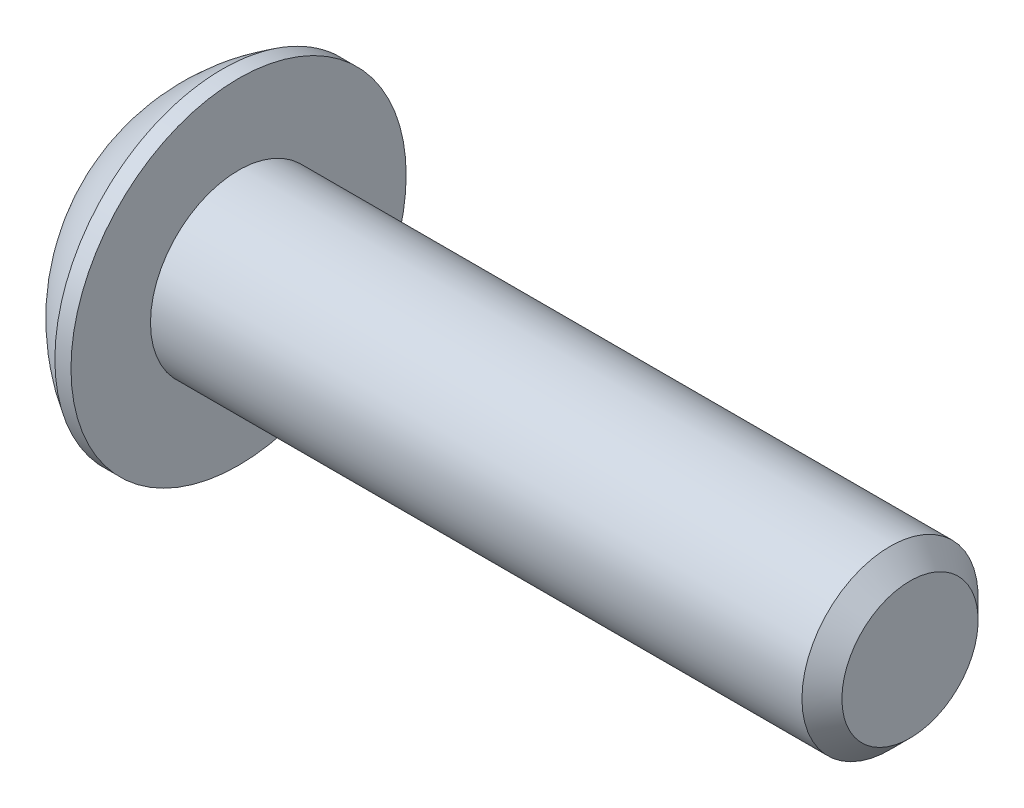
ISO-10303-21;
HEADER;
FILE_DESCRIPTION(('STEP AP214'),'2;1');
FILE_NAME('part.step','',(''),(''),'','','');
FILE_SCHEMA(('AUTOMOTIVE_DESIGN { 1 0 10303 214 1 1 1 1 }'));
ENDSEC;
DATA;
#1=APPLICATION_CONTEXT('core data for automotive mechanical design processes');
#2=APPLICATION_PROTOCOL_DEFINITION('international standard','automotive_design',2000,#1);
#3=PRODUCT_CONTEXT('',#1,'mechanical');
#4=PRODUCT('Part','Part','',(#3));
#5=PRODUCT_RELATED_PRODUCT_CATEGORY('part','',(#4));
#6=PRODUCT_DEFINITION_FORMATION('','',#4);
#7=PRODUCT_DEFINITION_CONTEXT('part definition',#1,'design');
#8=PRODUCT_DEFINITION('design','',#6,#7);
#9=PRODUCT_DEFINITION_SHAPE('','',#8);
#10=(LENGTH_UNIT() NAMED_UNIT(*) SI_UNIT(.MILLI.,.METRE.));
#11=(NAMED_UNIT(*) PLANE_ANGLE_UNIT() SI_UNIT($,.RADIAN.));
#12=(NAMED_UNIT(*) SI_UNIT($,.STERADIAN.) SOLID_ANGLE_UNIT());
#13=UNCERTAINTY_MEASURE_WITH_UNIT(LENGTH_MEASURE(1.E-05),#10,'distance_accuracy_value','');
#14=(GEOMETRIC_REPRESENTATION_CONTEXT(3) GLOBAL_UNCERTAINTY_ASSIGNED_CONTEXT((#13)) GLOBAL_UNIT_ASSIGNED_CONTEXT((#10,
#11,#12)) REPRESENTATION_CONTEXT('',''));
#15=CARTESIAN_POINT('',(0.,0.,0.));
#16=DIRECTION('',(0.,0.,1.));
#17=DIRECTION('',(1.,0.,0.));
#18=AXIS2_PLACEMENT_3D('',#15,#16,#17);
#19=CARTESIAN_POINT('',(1.32080000000034,0.,0.));
#20=DIRECTION('',(-1.,0.,0.));
#21=DIRECTION('',(0.,0.,1.));
#22=AXIS2_PLACEMENT_3D('',#19,#20,#21);
#23=CONICAL_SURFACE('',#22,1.1937999999998,1.04719755119608);
#24=CARTESIAN_POINT('',(2.01004075135902,0.,4.44089209850063E-13));
#25=VERTEX_POINT('',#24);
#26=VERTEX_LOOP('',#25);
#27=FACE_BOUND('',#26,.T.);
#28=CARTESIAN_POINT('',(1.32080000000009,0.,0.));
#29=DIRECTION('',(-1.,0.,0.));
#30=DIRECTION('',(0.,0.,1.));
#31=AXIS2_PLACEMENT_3D('',#28,#29,#30);
#32=CIRCLE('',#31,1.19380000000024);
#33=CARTESIAN_POINT('',(1.32080000000004,-1.03386112703797,0.59690000000006));
#34=VERTEX_POINT('',#33);
#35=CARTESIAN_POINT('',(1.32080000000004,0.,1.19380000000012));
#36=VERTEX_POINT('',#35);
#37=EDGE_CURVE('E19',#34,#36,#32,.T.);
#38=ORIENTED_EDGE('',*,*,#37,.T.);
#39=CARTESIAN_POINT('',(1.32080000000009,0.,0.));
#40=DIRECTION('',(-1.,0.,0.));
#41=DIRECTION('',(0.,0.,1.));
#42=AXIS2_PLACEMENT_3D('',#39,#40,#41);
#43=CIRCLE('',#42,1.19380000000024);
#44=CARTESIAN_POINT('',(1.32080000000004,1.03386112703797,0.596900000000061));
#45=VERTEX_POINT('',#44);
#46=EDGE_CURVE('E147',#36,#45,#43,.T.);
#47=ORIENTED_EDGE('',*,*,#46,.T.);
#48=CARTESIAN_POINT('',(1.32080000000009,0.,0.));
#49=DIRECTION('',(-1.,0.,0.));
#50=DIRECTION('',(0.,0.,1.));
#51=AXIS2_PLACEMENT_3D('',#48,#49,#50);
#52=CIRCLE('',#51,1.19380000000024);
#53=CARTESIAN_POINT('',(1.32080000000004,1.03386112703797,-0.596900000000061));
#54=VERTEX_POINT('',#53);
#55=EDGE_CURVE('E317',#45,#54,#52,.T.);
#56=ORIENTED_EDGE('',*,*,#55,.T.);
#57=CARTESIAN_POINT('',(1.32080000000009,0.,0.));
#58=DIRECTION('',(-1.,0.,0.));
#59=DIRECTION('',(0.,0.,1.));
#60=AXIS2_PLACEMENT_3D('',#57,#58,#59);
#61=CIRCLE('',#60,1.19380000000024);
#62=CARTESIAN_POINT('',(1.32080000000004,1.49457637585666E-12,-1.19380000000012));
#63=VERTEX_POINT('',#62);
#64=EDGE_CURVE('E318',#54,#63,#61,.T.);
#65=ORIENTED_EDGE('',*,*,#64,.T.);
#66=CARTESIAN_POINT('',(1.32080000000009,0.,0.));
#67=DIRECTION('',(-1.,0.,0.));
#68=DIRECTION('',(0.,0.,1.));
#69=AXIS2_PLACEMENT_3D('',#66,#67,#68);
#70=CIRCLE('',#69,1.19380000000024);
#71=CARTESIAN_POINT('',(1.32080000000004,-1.03386112703797,-0.59690000000006));
#72=VERTEX_POINT('',#71);
#73=EDGE_CURVE('E92',#63,#72,#70,.T.);
#74=ORIENTED_EDGE('',*,*,#73,.T.);
#75=CARTESIAN_POINT('',(1.32080000000009,0.,0.));
#76=DIRECTION('',(-1.,0.,0.));
#77=DIRECTION('',(0.,0.,1.));
#78=AXIS2_PLACEMENT_3D('',#75,#76,#77);
#79=CIRCLE('',#78,1.19380000000024);
#80=EDGE_CURVE('E88',#72,#34,#79,.T.);
#81=ORIENTED_EDGE('',*,*,#80,.T.);
#82=EDGE_LOOP('',(#38,#47,#56,#65,#74,#81));
#83=FACE_BOUND('',#82,.T.);
#84=ADVANCED_FACE('F16',(#27,#83),#23,.F.);
#85=CARTESIAN_POINT('',(1.3208,-2.06772225407572,-1.1938));
#86=DIRECTION('',(1.,0.,0.));
#87=DIRECTION('',(0.,0.,-1.));
#88=AXIS2_PLACEMENT_3D('',#85,#86,#87);
#89=PLANE('',#88);
#90=DIRECTION('',(0.,0.5,0.866025403784439));
#91=VECTOR('',#90,1.);
#92=CARTESIAN_POINT('',(1.3208,-1.37848150271715,0.));
#93=LINE('',#92,#91);
#94=CARTESIAN_POINT('',(1.3208,-0.689240751358574,1.1938));
#95=VERTEX_POINT('',#94);
#96=EDGE_CURVE('E100',#95,#34,#93,.F.);
#97=ORIENTED_EDGE('',*,*,#96,.F.);
#98=DIRECTION('',(0.,1.,0.));
#99=VECTOR('',#98,1.);
#100=CARTESIAN_POINT('',(1.3208,-0.689240751358574,1.1938));
#101=LINE('',#100,#99);
#102=EDGE_CURVE('E102',#36,#95,#101,.F.);
#103=ORIENTED_EDGE('',*,*,#102,.F.);
#104=ORIENTED_EDGE('',*,*,#37,.F.);
#105=EDGE_LOOP('',(#97,#103,#104));
#106=FACE_BOUND('',#105,.T.);
#107=ADVANCED_FACE('F98',(#106),#89,.F.);
#108=CARTESIAN_POINT('',(1.3208,-2.06772225407572,-1.1938));
#109=DIRECTION('',(1.,0.,0.));
#110=DIRECTION('',(0.,0.,-1.));
#111=AXIS2_PLACEMENT_3D('',#108,#109,#110);
#112=PLANE('',#111);
#113=DIRECTION('',(0.,-0.5,0.866025403784439));
#114=VECTOR('',#113,1.);
#115=CARTESIAN_POINT('',(1.3208,-0.689240751358574,-1.1938));
#116=LINE('',#115,#114);
#117=CARTESIAN_POINT('',(1.3208,-1.37848150271715,0.));
#118=VERTEX_POINT('',#117);
#119=EDGE_CURVE('E108',#118,#72,#116,.F.);
#120=ORIENTED_EDGE('',*,*,#119,.F.);
#121=DIRECTION('',(0.,0.5,0.866025403784439));
#122=VECTOR('',#121,1.);
#123=CARTESIAN_POINT('',(1.3208,-1.37848150271715,0.));
#124=LINE('',#123,#122);
#125=EDGE_CURVE('E105',#34,#118,#124,.F.);
#126=ORIENTED_EDGE('',*,*,#125,.F.);
#127=ORIENTED_EDGE('',*,*,#80,.F.);
#128=EDGE_LOOP('',(#120,#126,#127));
#129=FACE_BOUND('',#128,.T.);
#130=ADVANCED_FACE('F106',(#129),#112,.F.);
#131=CARTESIAN_POINT('',(1.3208,-2.06772225407572,-1.1938));
#132=DIRECTION('',(1.,0.,0.));
#133=DIRECTION('',(0.,0.,-1.));
#134=AXIS2_PLACEMENT_3D('',#131,#132,#133);
#135=PLANE('',#134);
#136=DIRECTION('',(0.,1.,0.));
#137=VECTOR('',#136,1.);
#138=CARTESIAN_POINT('',(1.3208,0.689240751358577,-1.1938));
#139=LINE('',#138,#137);
#140=CARTESIAN_POINT('',(1.3208,-0.689240751358574,-1.1938));
#141=VERTEX_POINT('',#140);
#142=EDGE_CURVE('E287',#141,#63,#139,.T.);
#143=ORIENTED_EDGE('',*,*,#142,.F.);
#144=DIRECTION('',(0.,-0.5,0.866025403784439));
#145=VECTOR('',#144,1.);
#146=CARTESIAN_POINT('',(1.3208,-0.689240751358574,-1.1938));
#147=LINE('',#146,#145);
#148=EDGE_CURVE('E299',#72,#141,#147,.F.);
#149=ORIENTED_EDGE('',*,*,#148,.F.);
#150=ORIENTED_EDGE('',*,*,#73,.F.);
#151=EDGE_LOOP('',(#143,#149,#150));
#152=FACE_BOUND('',#151,.T.);
#153=ADVANCED_FACE('F190',(#152),#135,.F.);
#154=CARTESIAN_POINT('',(1.3208,-2.06772225407572,-1.1938));
#155=DIRECTION('',(1.,0.,0.));
#156=DIRECTION('',(0.,0.,-1.));
#157=AXIS2_PLACEMENT_3D('',#154,#155,#156);
#158=PLANE('',#157);
#159=DIRECTION('',(0.,-0.5,-0.866025403784439));
#160=VECTOR('',#159,1.);
#161=CARTESIAN_POINT('',(1.3208,1.37848150271715,0.));
#162=LINE('',#161,#160);
#163=CARTESIAN_POINT('',(1.3208,0.689240751358577,-1.1938));
#164=VERTEX_POINT('',#163);
#165=EDGE_CURVE('E273',#164,#54,#162,.F.);
#166=ORIENTED_EDGE('',*,*,#165,.F.);
#167=DIRECTION('',(0.,1.,0.));
#168=VECTOR('',#167,1.);
#169=CARTESIAN_POINT('',(1.3208,0.689240751358577,-1.1938));
#170=LINE('',#169,#168);
#171=EDGE_CURVE('E284',#63,#164,#170,.T.);
#172=ORIENTED_EDGE('',*,*,#171,.F.);
#173=ORIENTED_EDGE('',*,*,#64,.F.);
#174=EDGE_LOOP('',(#166,#172,#173));
#175=FACE_BOUND('',#174,.T.);
#176=ADVANCED_FACE('F186',(#175),#158,.F.);
#177=CARTESIAN_POINT('',(1.3208,-2.06772225407572,-1.1938));
#178=DIRECTION('',(1.,0.,0.));
#179=DIRECTION('',(0.,0.,-1.));
#180=AXIS2_PLACEMENT_3D('',#177,#178,#179);
#181=PLANE('',#180);
#182=DIRECTION('',(0.,0.5,-0.866025403784439));
#183=VECTOR('',#182,1.);
#184=CARTESIAN_POINT('',(1.3208,0.689240751358576,1.1938));
#185=LINE('',#184,#183);
#186=CARTESIAN_POINT('',(1.3208,1.37848150271715,0.));
#187=VERTEX_POINT('',#186);
#188=EDGE_CURVE('E252',#187,#45,#185,.F.);
#189=ORIENTED_EDGE('',*,*,#188,.F.);
#190=DIRECTION('',(0.,-0.5,-0.866025403784439));
#191=VECTOR('',#190,1.);
#192=CARTESIAN_POINT('',(1.3208,1.37848150271715,0.));
#193=LINE('',#192,#191);
#194=EDGE_CURVE('E271',#54,#187,#193,.F.);
#195=ORIENTED_EDGE('',*,*,#194,.F.);
#196=ORIENTED_EDGE('',*,*,#55,.F.);
#197=EDGE_LOOP('',(#189,#195,#196));
#198=FACE_BOUND('',#197,.T.);
#199=ADVANCED_FACE('F182',(#198),#181,.F.);
#200=CARTESIAN_POINT('',(1.3208,-2.06772225407572,-1.1938));
#201=DIRECTION('',(1.,0.,0.));
#202=DIRECTION('',(0.,0.,-1.));
#203=AXIS2_PLACEMENT_3D('',#200,#201,#202);
#204=PLANE('',#203);
#205=DIRECTION('',(0.,1.,0.));
#206=VECTOR('',#205,1.);
#207=CARTESIAN_POINT('',(1.3208,-0.689240751358574,1.1938));
#208=LINE('',#207,#206);
#209=CARTESIAN_POINT('',(1.3208,0.689240751358576,1.1938));
#210=VERTEX_POINT('',#209);
#211=EDGE_CURVE('E117',#210,#36,#208,.F.);
#212=ORIENTED_EDGE('',*,*,#211,.F.);
#213=DIRECTION('',(0.,0.5,-0.866025403784439));
#214=VECTOR('',#213,1.);
#215=CARTESIAN_POINT('',(1.3208,0.689240751358576,1.1938));
#216=LINE('',#215,#214);
#217=EDGE_CURVE('E255',#45,#210,#216,.F.);
#218=ORIENTED_EDGE('',*,*,#217,.F.);
#219=ORIENTED_EDGE('',*,*,#46,.F.);
#220=EDGE_LOOP('',(#212,#218,#219));
#221=FACE_BOUND('',#220,.T.);
#222=ADVANCED_FACE('F178',(#221),#204,.F.);
#223=CARTESIAN_POINT('',(1.3208,-0.689240751358574,1.1938));
#224=DIRECTION('',(0.,0.,-1.));
#225=DIRECTION('',(0.,1.,0.));
#226=AXIS2_PLACEMENT_3D('',#223,#224,#225);
#227=PLANE('',#226);
#228=DIRECTION('',(0.,1.,0.));
#229=VECTOR('',#228,1.);
#230=CARTESIAN_POINT('',(0.,0.,1.1938));
#231=LINE('',#230,#229);
#232=CARTESIAN_POINT('',(0.,0.689240751358577,1.1938));
#233=VERTEX_POINT('',#232);
#234=CARTESIAN_POINT('',(0.,-0.689240751358574,1.1938));
#235=VERTEX_POINT('',#234);
#236=EDGE_CURVE('E249',#233,#235,#231,.F.);
#237=ORIENTED_EDGE('',*,*,#236,.F.);
#238=DIRECTION('',(1.,0.,0.));
#239=VECTOR('',#238,1.);
#240=CARTESIAN_POINT('',(1.3208,0.689240751358576,1.1938));
#241=LINE('',#240,#239);
#242=EDGE_CURVE('E261',#210,#233,#241,.F.);
#243=ORIENTED_EDGE('',*,*,#242,.F.);
#244=ORIENTED_EDGE('',*,*,#211,.T.);
#245=ORIENTED_EDGE('',*,*,#102,.T.);
#246=DIRECTION('',(1.,0.,0.));
#247=VECTOR('',#246,1.);
#248=CARTESIAN_POINT('',(1.3208,-0.689240751358574,1.1938));
#249=LINE('',#248,#247);
#250=EDGE_CURVE('E111',#235,#95,#249,.T.);
#251=ORIENTED_EDGE('',*,*,#250,.F.);
#252=EDGE_LOOP('',(#237,#243,#244,#245,#251));
#253=FACE_BOUND('',#252,.T.);
#254=ADVANCED_FACE('F175',(#253),#227,.T.);
#255=CARTESIAN_POINT('',(1.3208,-1.37848150271715,0.));
#256=DIRECTION('',(0.,0.866025403784439,-0.5));
#257=DIRECTION('',(0.,0.5,0.866025403784439));
#258=AXIS2_PLACEMENT_3D('',#255,#256,#257);
#259=PLANE('',#258);
#260=DIRECTION('',(0.,-0.5,-0.866025403784439));
#261=VECTOR('',#260,1.);
#262=CARTESIAN_POINT('',(0.,-0.689240751358574,1.1938));
#263=LINE('',#262,#261);
#264=CARTESIAN_POINT('',(0.,-1.37848150271715,0.));
#265=VERTEX_POINT('',#264);
#266=EDGE_CURVE('E246',#235,#265,#263,.T.);
#267=ORIENTED_EDGE('',*,*,#266,.F.);
#268=ORIENTED_EDGE('',*,*,#250,.T.);
#269=ORIENTED_EDGE('',*,*,#96,.T.);
#270=ORIENTED_EDGE('',*,*,#125,.T.);
#271=DIRECTION('',(1.,0.,0.));
#272=VECTOR('',#271,1.);
#273=CARTESIAN_POINT('',(1.3208,-1.37848150271715,0.));
#274=LINE('',#273,#272);
#275=EDGE_CURVE('E296',#265,#118,#274,.T.);
#276=ORIENTED_EDGE('',*,*,#275,.F.);
#277=EDGE_LOOP('',(#267,#268,#269,#270,#276));
#278=FACE_BOUND('',#277,.T.);
#279=ADVANCED_FACE('F115',(#278),#259,.T.);
#280=CARTESIAN_POINT('',(1.3208,-0.689240751358574,-1.1938));
#281=DIRECTION('',(0.,0.866025403784439,0.5));
#282=DIRECTION('',(0.,-0.5,0.866025403784439));
#283=AXIS2_PLACEMENT_3D('',#280,#281,#282);
#284=PLANE('',#283);
#285=DIRECTION('',(0.,0.5,-0.866025403784439));
#286=VECTOR('',#285,1.);
#287=CARTESIAN_POINT('',(0.,-1.37848150271715,0.));
#288=LINE('',#287,#286);
#289=CARTESIAN_POINT('',(0.,-0.689240751358574,-1.1938));
#290=VERTEX_POINT('',#289);
#291=EDGE_CURVE('E243',#265,#290,#288,.T.);
#292=ORIENTED_EDGE('',*,*,#291,.F.);
#293=ORIENTED_EDGE('',*,*,#275,.T.);
#294=ORIENTED_EDGE('',*,*,#119,.T.);
#295=ORIENTED_EDGE('',*,*,#148,.T.);
#296=DIRECTION('',(1.,0.,0.));
#297=VECTOR('',#296,1.);
#298=CARTESIAN_POINT('',(1.3208,-0.689240751358574,-1.1938));
#299=LINE('',#298,#297);
#300=EDGE_CURVE('E281',#290,#141,#299,.T.);
#301=ORIENTED_EDGE('',*,*,#300,.F.);
#302=EDGE_LOOP('',(#292,#293,#294,#295,#301));
#303=FACE_BOUND('',#302,.T.);
#304=ADVANCED_FACE('F168',(#303),#284,.T.);
#305=CARTESIAN_POINT('',(1.3208,0.689240751358577,-1.1938));
#306=DIRECTION('',(0.,0.,1.));
#307=DIRECTION('',(1.,0.,0.));
#308=AXIS2_PLACEMENT_3D('',#305,#306,#307);
#309=PLANE('',#308);
#310=DIRECTION('',(0.,1.,0.));
#311=VECTOR('',#310,1.);
#312=CARTESIAN_POINT('',(0.,0.,-1.1938));
#313=LINE('',#312,#311);
#314=CARTESIAN_POINT('',(0.,0.689240751358577,-1.1938));
#315=VERTEX_POINT('',#314);
#316=EDGE_CURVE('E240',#290,#315,#313,.T.);
#317=ORIENTED_EDGE('',*,*,#316,.F.);
#318=ORIENTED_EDGE('',*,*,#300,.T.);
#319=ORIENTED_EDGE('',*,*,#142,.T.);
#320=ORIENTED_EDGE('',*,*,#171,.T.);
#321=DIRECTION('',(1.,0.,0.));
#322=VECTOR('',#321,1.);
#323=CARTESIAN_POINT('',(1.3208,0.689240751358577,-1.1938));
#324=LINE('',#323,#322);
#325=EDGE_CURVE('E256',#315,#164,#324,.T.);
#326=ORIENTED_EDGE('',*,*,#325,.F.);
#327=EDGE_LOOP('',(#317,#318,#319,#320,#326));
#328=FACE_BOUND('',#327,.T.);
#329=ADVANCED_FACE('F165',(#328),#309,.T.);
#330=CARTESIAN_POINT('',(1.3208,1.37848150271715,0.));
#331=DIRECTION('',(0.,-0.866025403784439,0.5));
#332=DIRECTION('',(0.,-0.5,-0.866025403784439));
#333=AXIS2_PLACEMENT_3D('',#330,#331,#332);
#334=PLANE('',#333);
#335=DIRECTION('',(0.,0.5,0.866025403784439));
#336=VECTOR('',#335,1.);
#337=CARTESIAN_POINT('',(0.,0.689240751358577,-1.1938));
#338=LINE('',#337,#336);
#339=CARTESIAN_POINT('',(0.,1.37848150271715,0.));
#340=VERTEX_POINT('',#339);
#341=EDGE_CURVE('E237',#315,#340,#338,.T.);
#342=ORIENTED_EDGE('',*,*,#341,.F.);
#343=ORIENTED_EDGE('',*,*,#325,.T.);
#344=ORIENTED_EDGE('',*,*,#165,.T.);
#345=ORIENTED_EDGE('',*,*,#194,.T.);
#346=DIRECTION('',(1.,0.,0.));
#347=VECTOR('',#346,1.);
#348=CARTESIAN_POINT('',(1.3208,1.37848150271715,0.));
#349=LINE('',#348,#347);
#350=EDGE_CURVE('E34',#340,#187,#349,.T.);
#351=ORIENTED_EDGE('',*,*,#350,.F.);
#352=EDGE_LOOP('',(#342,#343,#344,#345,#351));
#353=FACE_BOUND('',#352,.T.);
#354=ADVANCED_FACE('F161',(#353),#334,.T.);
#355=CARTESIAN_POINT('',(1.3208,0.689240751358576,1.1938));
#356=DIRECTION('',(0.,-0.866025403784439,-0.5));
#357=DIRECTION('',(0.,0.5,-0.866025403784439));
#358=AXIS2_PLACEMENT_3D('',#355,#356,#357);
#359=PLANE('',#358);
#360=DIRECTION('',(0.,-0.5,0.866025403784439));
#361=VECTOR('',#360,1.);
#362=CARTESIAN_POINT('',(0.,1.37848150271715,0.));
#363=LINE('',#362,#361);
#364=EDGE_CURVE('E146',#340,#233,#363,.T.);
#365=ORIENTED_EDGE('',*,*,#364,.F.);
#366=ORIENTED_EDGE('',*,*,#350,.T.);
#367=ORIENTED_EDGE('',*,*,#188,.T.);
#368=ORIENTED_EDGE('',*,*,#217,.T.);
#369=ORIENTED_EDGE('',*,*,#242,.T.);
#370=EDGE_LOOP('',(#365,#366,#367,#368,#369));
#371=FACE_BOUND('',#370,.T.);
#372=ADVANCED_FACE('F157',(#371),#359,.T.);
#373=CARTESIAN_POINT('',(0.,0.,0.));
#374=DIRECTION('',(-1.,0.,0.));
#375=DIRECTION('',(0.,0.,1.));
#376=AXIS2_PLACEMENT_3D('',#373,#374,#375);
#377=PLANE('',#376);
#378=ORIENTED_EDGE('',*,*,#341,.T.);
#379=ORIENTED_EDGE('',*,*,#364,.T.);
#380=ORIENTED_EDGE('',*,*,#236,.T.);
#381=ORIENTED_EDGE('',*,*,#266,.T.);
#382=ORIENTED_EDGE('',*,*,#291,.T.);
#383=ORIENTED_EDGE('',*,*,#316,.T.);
#384=EDGE_LOOP('',(#378,#379,#380,#381,#382,#383));
#385=FACE_BOUND('',#384,.T.);
#386=CARTESIAN_POINT('',(0.,1.9812,0.));
#387=CARTESIAN_POINT('',(0.,1.9811996664299,0.0556258831179428));
#388=CARTESIAN_POINT('',(0.,1.97885520380442,0.111261989398606));
#389=CARTESIAN_POINT('',(0.,1.96949260169541,0.222149719830458));
#390=CARTESIAN_POINT('',(0.,1.96247308239605,0.277401225602895));
#391=CARTESIAN_POINT('',(0.,1.94379192841038,0.387209508139747));
#392=CARTESIAN_POINT('',(-1.85325793235264E-13,1.93212292489526,0.441765039546365));
#393=CARTESIAN_POINT('',(1.86344214223505E-13,1.90422331175315,0.549729449347493));
#394=CARTESIAN_POINT('',(6.94543371897454E-13,1.88798900035338,0.603137359208869));
#395=CARTESIAN_POINT('',(1.15501975216981E-12,1.83266214476501,0.760839131321828));
#396=CARTESIAN_POINT('',(0.,1.78690023648845,0.862876433575429));
#397=CARTESIAN_POINT('',(0.,1.67887358150667,1.05780719540872));
#398=CARTESIAN_POINT('',(9.54193214892627E-13,1.6166082074585,1.15070030720801));
#399=CARTESIAN_POINT('',(5.94805591894675E-13,1.51224157140982,1.28116890915697));
#400=CARTESIAN_POINT('',(1.63221293851378E-13,1.4755970394354,1.32320451127026));
#401=CARTESIAN_POINT('',(-1.62196980336157E-13,1.39893832619713,1.40400288695709));
#402=CARTESIAN_POINT('',(0.,1.35892742784698,1.44276877695455));
#403=CARTESIAN_POINT('',(1.14362537325405E-13,1.23416504602197,1.55382272417904));
#404=CARTESIAN_POINT('',(0.,1.14466125559859,1.62089527952111));
#405=CARTESIAN_POINT('',(0.,0.955712144178167,1.7390221808118));
#406=CARTESIAN_POINT('',(0.,0.856267198233564,1.79007713076007));
#407=CARTESIAN_POINT('',(0.,0.650206345910843,1.87477637530954));
#408=CARTESIAN_POINT('',(0.,0.543590516134855,1.90842085586267));
#409=CARTESIAN_POINT('',(0.,0.326226155292018,1.95733039300656));
#410=CARTESIAN_POINT('',(0.,0.21547760215793,1.97259535144288));
#411=CARTESIAN_POINT('',(0.,-0.00701040587544639,1.98431697865418));
#412=CARTESIAN_POINT('',(0.,-0.118749860774734,1.98077364742917));
#413=CARTESIAN_POINT('',(0.,-0.340050178355485,1.95497485623825));
#414=CARTESIAN_POINT('',(0.,-0.449611052668255,1.93271949620218));
#415=CARTESIAN_POINT('',(0.,-0.663431110729174,1.87014138774523));
#416=CARTESIAN_POINT('',(0.,-0.76769023783852,1.82981844635272));
#417=CARTESIAN_POINT('',(0.,-0.968005760719347,1.73219968377096));
#418=CARTESIAN_POINT('',(0.,-1.0640618469811,1.6749032225164));
#419=CARTESIAN_POINT('',(0.,-1.19980276751283,1.57757371205873));
#420=CARTESIAN_POINT('',(0.,-1.24366557129213,1.54322665019466));
#421=CARTESIAN_POINT('',(0.,-1.32838995706696,1.47093063174264));
#422=CARTESIAN_POINT('',(0.,-1.36924860178706,1.43297823102439));
#423=CARTESIAN_POINT('',(0.,-1.48674671849223,1.31419842051173));
#424=CARTESIAN_POINT('',(0.,-1.55842832343237,1.22836221289311));
#425=CARTESIAN_POINT('',(0.,-1.6863396856475,1.04586168272493));
#426=CARTESIAN_POINT('',(0.,-1.7425700302488,0.949197771949774));
#427=CARTESIAN_POINT('',(0.,-1.8141614250401,0.798182600298684));
#428=CARTESIAN_POINT('',(0.,-1.83591780585875,0.746776203847791));
#429=CARTESIAN_POINT('',(0.,-1.87500754181092,0.642341081688636));
#430=CARTESIAN_POINT('',(0.,-1.89234447645404,0.589313708122847));
#431=CARTESIAN_POINT('',(0.,-1.92246053433554,0.482076273028395));
#432=CARTESIAN_POINT('',(0.,-1.93524685475118,0.42786822425751));
#433=CARTESIAN_POINT('',(0.,-1.95620937250494,0.318578151844611));
#434=CARTESIAN_POINT('',(0.,-1.96438692958147,0.263496390912872));
#435=CARTESIAN_POINT('',(0.,-1.97388528284653,0.173607715038558));
#436=CARTESIAN_POINT('',(0.,-1.97662743364426,0.138944718024998));
#437=CARTESIAN_POINT('',(0.,-1.98028489645283,0.0695224782567002));
#438=CARTESIAN_POINT('',(0.,-1.98120020846367,0.0347632355019631));
#439=CARTESIAN_POINT('',(0.,-1.9811996664299,-0.0556258831179437));
#440=CARTESIAN_POINT('',(0.,-1.97885520380442,-0.111261989398607));
#441=CARTESIAN_POINT('',(0.,-1.96949260169541,-0.222149719830459));
#442=CARTESIAN_POINT('',(0.,-1.96247308239605,-0.277401225602897));
#443=CARTESIAN_POINT('',(0.,-1.94379192841039,-0.387209508139749));
#444=CARTESIAN_POINT('',(-1.85269749640691E-13,-1.93212292489526,-0.441765039546367));
#445=CARTESIAN_POINT('',(1.86288125054388E-13,-1.90422331175315,-0.549729449347495));
#446=CARTESIAN_POINT('',(6.94525090263764E-13,-1.88798900035338,-0.603137359208872));
#447=CARTESIAN_POINT('',(1.15505622829081E-12,-1.83266214476501,-0.760839131321831));
#448=CARTESIAN_POINT('',(0.,-1.78690023648845,-0.862876433575431));
#449=CARTESIAN_POINT('',(0.,-1.67887358150667,-1.05780719540872));
#450=CARTESIAN_POINT('',(9.54248812869379E-13,-1.6166082074585,-1.15070030720801));
#451=CARTESIAN_POINT('',(5.94777756479239E-13,-1.51224157140982,-1.28116890915698));
#452=CARTESIAN_POINT('',(1.63138949183833E-13,-1.47559703943539,-1.32320451127027));
#453=CARTESIAN_POINT('',(-1.62114715061273E-13,-1.39893832619713,-1.40400288695709));
#454=CARTESIAN_POINT('',(0.,-1.35892742784699,-1.44276877695455));
#455=CARTESIAN_POINT('',(1.13760489124207E-13,-1.23416504602197,-1.55382272417904));
#456=CARTESIAN_POINT('',(0.,-1.14466125559859,-1.62089527952111));
#457=CARTESIAN_POINT('',(0.,-0.95571214417816,-1.73902218081179));
#458=CARTESIAN_POINT('',(0.,-0.856267198233559,-1.79007713076007));
#459=CARTESIAN_POINT('',(0.,-0.650206345910841,-1.87477637530954));
#460=CARTESIAN_POINT('',(0.,-0.543590516134854,-1.90842085586267));
#461=CARTESIAN_POINT('',(0.,-0.326226155292018,-1.95733039300657));
#462=CARTESIAN_POINT('',(0.,-0.215477602157929,-1.97259535144288));
#463=CARTESIAN_POINT('',(0.,0.0070104058754487,-1.98431697865418));
#464=CARTESIAN_POINT('',(0.,0.118749860774737,-1.98077364742916));
#465=CARTESIAN_POINT('',(0.,0.340050178355489,-1.95497485623824));
#466=CARTESIAN_POINT('',(0.,0.44961105266826,-1.93271949620218));
#467=CARTESIAN_POINT('',(0.,0.663431110729178,-1.87014138774524));
#468=CARTESIAN_POINT('',(0.,0.767690237838524,-1.82981844635272));
#469=CARTESIAN_POINT('',(0.,0.968005760719348,-1.73219968377096));
#470=CARTESIAN_POINT('',(0.,1.0640618469811,-1.67490322251639));
#471=CARTESIAN_POINT('',(0.,1.19980276751283,-1.57757371205873));
#472=CARTESIAN_POINT('',(0.,1.24366557129214,-1.54322665019465));
#473=CARTESIAN_POINT('',(0.,1.32838995706696,-1.47093063174263));
#474=CARTESIAN_POINT('',(0.,1.36924860178706,-1.43297823102439));
#475=CARTESIAN_POINT('',(0.,1.48674671849223,-1.31419842051172));
#476=CARTESIAN_POINT('',(0.,1.55842832343237,-1.22836221289311));
#477=CARTESIAN_POINT('',(0.,1.6863396856475,-1.04586168272492));
#478=CARTESIAN_POINT('',(0.,1.7425700302488,-0.949197771949768));
#479=CARTESIAN_POINT('',(0.,1.8141614250401,-0.798182600298677));
#480=CARTESIAN_POINT('',(0.,1.83591780585875,-0.746776203847785));
#481=CARTESIAN_POINT('',(0.,1.87500754181092,-0.64234108168863));
#482=CARTESIAN_POINT('',(0.,1.89234447645404,-0.589313708122841));
#483=CARTESIAN_POINT('',(0.,1.92246053433555,-0.482076273028389));
#484=CARTESIAN_POINT('',(0.,1.93524685475118,-0.427868224257505));
#485=CARTESIAN_POINT('',(0.,1.95620937250494,-0.318578151844605));
#486=CARTESIAN_POINT('',(0.,1.96438692958147,-0.263496390912866));
#487=CARTESIAN_POINT('',(0.,1.97388528284653,-0.173607715038553));
#488=CARTESIAN_POINT('',(0.,1.97662743364426,-0.138944718024994));
#489=CARTESIAN_POINT('',(0.,1.98028489645283,-0.0695224782566989));
#490=CARTESIAN_POINT('',(0.,1.98120020846367,-0.034763235501963));
#491=CARTESIAN_POINT('',(0.,1.9812,0.));
#492=B_SPLINE_CURVE_WITH_KNOTS('',3,(#386,#387,#388,#389,#390,#391,#392,#393,#394,#395,#396,
#397,#398,#399,#400,#401,#402,#403,#404,#405,#406,#407,#408,#409,#410,#411,#412,#413,#414,#415,
#416,#417,#418,#419,#420,#421,#422,#423,#424,#425,#426,#427,#428,#429,#430,#431,#432,#433,#434,
#435,#436,#437,#438,#439,#440,#441,#442,#443,#444,#445,#446,#447,#448,#449,#450,#451,#452,#453,
#454,#455,#456,#457,#458,#459,#460,#461,#462,#463,#464,#465,#466,#467,#468,#469,#470,#471,#472,
#473,#474,#475,#476,#477,#478,#479,#480,#481,#482,#483,#484,#485,#486,#487,#488,#489,#490,#491),
.UNSPECIFIED.,.T.,.F.,(4,2,2,2,2,2,2,2,2,2,2,2,2,2,2,2,2,2,2,2,2,2,2,2,2,2,2,2,2,2,2,2,2,2,2,2,
2,2,2,2,2,2,2,2,2,2,2,2,2,2,2,2,4),(0.,0.166845646007828,0.333740557374255,0.500901034367693,
0.668197445942386,1.00199278686282,1.33580081809885,1.50292354032982,1.6698851310853,
2.00370118900129,2.33750465770544,2.67130456115909,3.005106247238,3.33890793331696,
3.67270783677065,4.00651130547476,4.34032736339026,4.50728895414554,4.67441167637632,
5.00821970761259,5.34201504853332,5.50931146010827,5.67647193710191,5.84336684846844,
6.0102124944764,6.11448220058334,6.21875190669029,6.38559755269812,6.55249246406454,
6.71965294105798,6.88694935263268,7.22074469355311,7.55455272478915,7.72167544702011,
7.88863703777559,8.22245309569158,8.55625656439573,8.89005646784938,9.2238581539283,
9.55765984000725,9.89145974346094,10.2252632121651,10.5590792700806,10.7260408608358,
10.8931635830666,11.2269716143029,11.5607669552236,11.7280633667986,11.8952238437922,
12.0621187551587,12.2289644011667,12.3332341072736,12.4375038133806),.UNSPECIFIED.);
#493=CARTESIAN_POINT('',(0.,1.9812,0.));
#494=VERTEX_POINT('',#493);
#495=EDGE_CURVE('E139',#494,#494,#492,.T.);
#496=ORIENTED_EDGE('',*,*,#495,.F.);
#497=EDGE_LOOP('',(#496));
#498=FACE_BOUND('',#497,.T.);
#499=ADVANCED_FACE('F153',(#385,#498),#377,.T.);
#500=CARTESIAN_POINT('',(4.13385,0.,0.));
#501=DIRECTION('',(0.,1.,0.));
#502=DIRECTION('',(1.,0.,0.));
#503=AXIS2_PLACEMENT_3D('',#500,#501,#502);
#504=SPHERICAL_SURFACE('',#503,4.58408870578439);
#505=CARTESIAN_POINT('',(1.8288,0.,0.));
#506=DIRECTION('',(-1.,0.,0.));
#507=DIRECTION('',(0.,0.,1.));
#508=AXIS2_PLACEMENT_3D('',#505,#506,#507);
#509=CIRCLE('',#508,3.9624);
#510=CARTESIAN_POINT('',(1.8288,0.,3.9624));
#511=VERTEX_POINT('',#510);
#512=EDGE_CURVE('E136',#511,#511,#509,.F.);
#513=ORIENTED_EDGE('',*,*,#512,.F.);
#514=EDGE_LOOP('',(#513));
#515=FACE_BOUND('',#514,.T.);
#516=ORIENTED_EDGE('',*,*,#495,.T.);
#517=EDGE_LOOP('',(#516));
#518=FACE_BOUND('',#517,.T.);
#519=ADVANCED_FACE('F149',(#515,#518),#504,.T.);
#520=CARTESIAN_POINT('',(18.0848,0.,0.));
#521=DIRECTION('',(-1.,0.,0.));
#522=DIRECTION('',(0.,0.,1.));
#523=AXIS2_PLACEMENT_3D('',#520,#521,#522);
#524=PLANE('',#523);
#525=CARTESIAN_POINT('',(18.0847999999969,0.,0.));
#526=DIRECTION('',(-1.,0.,0.));
#527=DIRECTION('',(0.,0.,1.));
#528=AXIS2_PLACEMENT_3D('',#525,#526,#527);
#529=CIRCLE('',#528,1.61036000002923);
#530=CARTESIAN_POINT('',(18.0847999999969,0.,1.61036000002923));
#531=VERTEX_POINT('',#530);
#532=EDGE_CURVE('E133',#531,#531,#529,.T.);
#533=ORIENTED_EDGE('',*,*,#532,.F.);
#534=EDGE_LOOP('',(#533));
#535=FACE_BOUND('',#534,.T.);
#536=ADVANCED_FACE('F221',(#535),#524,.F.);
#537=CARTESIAN_POINT('',(0.,0.,0.));
#538=DIRECTION('',(-1.,0.,0.));
#539=DIRECTION('',(0.,0.,1.));
#540=AXIS2_PLACEMENT_3D('',#537,#538,#539);
#541=CYLINDRICAL_SURFACE('',#540,3.9624);
#542=ORIENTED_EDGE('',*,*,#512,.T.);
#543=EDGE_LOOP('',(#542));
#544=FACE_BOUND('',#543,.T.);
#545=CARTESIAN_POINT('',(2.2098,0.,0.));
#546=DIRECTION('',(-1.,0.,0.));
#547=DIRECTION('',(0.,0.,1.));
#548=AXIS2_PLACEMENT_3D('',#545,#546,#547);
#549=CIRCLE('',#548,3.9624);
#550=CARTESIAN_POINT('',(2.2098,0.,3.9624));
#551=VERTEX_POINT('',#550);
#552=EDGE_CURVE('E130',#551,#551,#549,.T.);
#553=ORIENTED_EDGE('',*,*,#552,.T.);
#554=EDGE_LOOP('',(#553));
#555=FACE_BOUND('',#554,.T.);
#556=ADVANCED_FACE('F218',(#544,#555),#541,.T.);
#557=CARTESIAN_POINT('',(17.61235999993,0.,0.));
#558=DIRECTION('',(-1.,0.,0.));
#559=DIRECTION('',(0.,0.,1.));
#560=AXIS2_PLACEMENT_3D('',#557,#558,#559);
#561=CONICAL_SURFACE('',#560,2.08280000009609,0.785398163397448);
#562=ORIENTED_EDGE('',*,*,#532,.T.);
#563=EDGE_LOOP('',(#562));
#564=FACE_BOUND('',#563,.T.);
#565=CARTESIAN_POINT('',(17.61236,0.,0.));
#566=DIRECTION('',(-1.,0.,0.));
#567=DIRECTION('',(0.,0.,1.));
#568=AXIS2_PLACEMENT_3D('',#565,#566,#567);
#569=CIRCLE('',#568,2.0828);
#570=CARTESIAN_POINT('',(17.61236,0.,2.0828));
#571=VERTEX_POINT('',#570);
#572=EDGE_CURVE('E25',#571,#571,#569,.T.);
#573=ORIENTED_EDGE('',*,*,#572,.F.);
#574=EDGE_LOOP('',(#573));
#575=FACE_BOUND('',#574,.T.);
#576=ADVANCED_FACE('F210',(#564,#575),#561,.T.);
#577=CARTESIAN_POINT('',(2.2098,2.0828,0.));
#578=DIRECTION('',(-1.,0.,0.));
#579=DIRECTION('',(0.,0.,1.));
#580=AXIS2_PLACEMENT_3D('',#577,#578,#579);
#581=PLANE('',#580);
#582=CARTESIAN_POINT('',(2.2098,0.,0.));
#583=DIRECTION('',(-1.,0.,0.));
#584=DIRECTION('',(0.,0.,1.));
#585=AXIS2_PLACEMENT_3D('',#582,#583,#584);
#586=CIRCLE('',#585,2.0828);
#587=CARTESIAN_POINT('',(2.2098,0.,2.0828));
#588=VERTEX_POINT('',#587);
#589=EDGE_CURVE('E10',#588,#588,#586,.F.);
#590=ORIENTED_EDGE('',*,*,#589,.F.);
#591=EDGE_LOOP('',(#590));
#592=FACE_BOUND('',#591,.T.);
#593=ORIENTED_EDGE('',*,*,#552,.F.);
#594=EDGE_LOOP('',(#593));
#595=FACE_BOUND('',#594,.T.);
#596=ADVANCED_FACE('F204',(#592,#595),#581,.F.);
#597=CARTESIAN_POINT('',(0.,0.,0.));
#598=DIRECTION('',(-1.,0.,0.));
#599=DIRECTION('',(0.,0.,1.));
#600=AXIS2_PLACEMENT_3D('',#597,#598,#599);
#601=CYLINDRICAL_SURFACE('',#600,2.0828);
#602=ORIENTED_EDGE('',*,*,#572,.T.);
#603=EDGE_LOOP('',(#602));
#604=FACE_BOUND('',#603,.T.);
#605=ORIENTED_EDGE('',*,*,#589,.T.);
#606=EDGE_LOOP('',(#605));
#607=FACE_BOUND('',#606,.T.);
#608=ADVANCED_FACE('F202',(#604,#607),#601,.T.);
#609=CLOSED_SHELL('',(#84,#107,#130,#153,#176,#199,#222,#254,#279,#304,#329,#354,#372,#499,#519,
#536,#556,#576,#596,#608));
#610=MANIFOLD_SOLID_BREP('B1',#609);
#611=ADVANCED_BREP_SHAPE_REPRESENTATION('',(#18,#610),#14);
#612=SHAPE_DEFINITION_REPRESENTATION(#9,#611);
ENDSEC;
END-ISO-10303-21;
